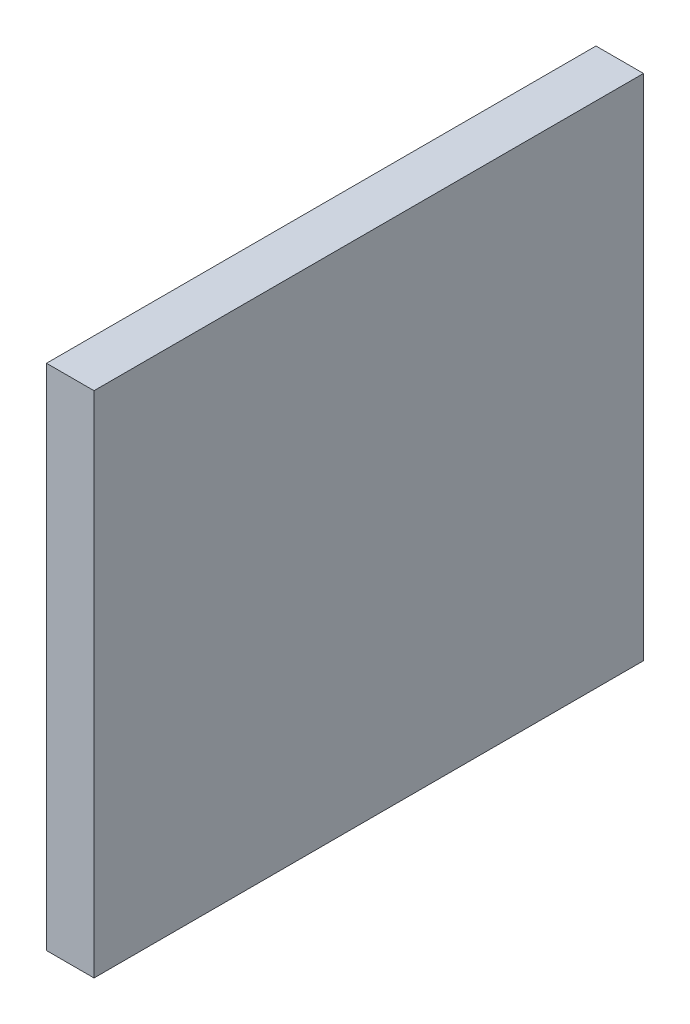
ISO-10303-21;
HEADER;
FILE_DESCRIPTION(('STEP AP214'),'2;1');
FILE_NAME('part.step','',(''),(''),'','','');
FILE_SCHEMA(('AUTOMOTIVE_DESIGN { 1 0 10303 214 1 1 1 1 }'));
ENDSEC;
DATA;
#1=APPLICATION_CONTEXT('core data for automotive mechanical design processes');
#2=APPLICATION_PROTOCOL_DEFINITION('international standard','automotive_design',2000,#1);
#3=PRODUCT_CONTEXT('',#1,'mechanical');
#4=PRODUCT('Part','Part','',(#3));
#5=PRODUCT_RELATED_PRODUCT_CATEGORY('part','',(#4));
#6=PRODUCT_DEFINITION_FORMATION('','',#4);
#7=PRODUCT_DEFINITION_CONTEXT('part definition',#1,'design');
#8=PRODUCT_DEFINITION('design','',#6,#7);
#9=PRODUCT_DEFINITION_SHAPE('','',#8);
#10=(LENGTH_UNIT() NAMED_UNIT(*) SI_UNIT(.MILLI.,.METRE.));
#11=(NAMED_UNIT(*) PLANE_ANGLE_UNIT() SI_UNIT($,.RADIAN.));
#12=(NAMED_UNIT(*) SI_UNIT($,.STERADIAN.) SOLID_ANGLE_UNIT());
#13=UNCERTAINTY_MEASURE_WITH_UNIT(LENGTH_MEASURE(1.E-05),#10,'distance_accuracy_value','');
#14=(GEOMETRIC_REPRESENTATION_CONTEXT(3) GLOBAL_UNCERTAINTY_ASSIGNED_CONTEXT((#13)) GLOBAL_UNIT_ASSIGNED_CONTEXT((#10,
#11,#12)) REPRESENTATION_CONTEXT('',''));
#15=CARTESIAN_POINT('',(0.,0.,0.));
#16=DIRECTION('',(0.,0.,1.));
#17=DIRECTION('',(1.,0.,0.));
#18=AXIS2_PLACEMENT_3D('',#15,#16,#17);
#19=CARTESIAN_POINT('',(-113.6,0.,-220.264426124934));
#20=DIRECTION('',(-1.,0.,0.));
#21=DIRECTION('',(0.,-1.,0.));
#22=AXIS2_PLACEMENT_3D('',#19,#20,#21);
#23=PLANE('',#22);
#24=DIRECTION('',(0.,1.,0.));
#25=VECTOR('',#24,1.);
#26=CARTESIAN_POINT('',(-113.6,0.,-274.));
#27=LINE('',#26,#25);
#28=CARTESIAN_POINT('',(-113.6,-53.5024476045967,-274.));
#29=VERTEX_POINT('',#28);
#30=CARTESIAN_POINT('',(-113.6,0.,-274.));
#31=VERTEX_POINT('',#30);
#32=EDGE_CURVE('E83',#29,#31,#27,.T.);
#33=ORIENTED_EDGE('',*,*,#32,.F.);
#34=DIRECTION('',(0.,0.,-1.));
#35=VECTOR('',#34,1.);
#36=CARTESIAN_POINT('',(-113.6,-53.5024476045967,-220.264426124934));
#37=LINE('',#36,#35);
#38=CARTESIAN_POINT('',(-113.6,-53.5024476045967,-331.8));
#39=VERTEX_POINT('',#38);
#40=EDGE_CURVE('E37',#29,#39,#37,.T.);
#41=ORIENTED_EDGE('',*,*,#40,.T.);
#42=DIRECTION('',(0.,1.,0.));
#43=VECTOR('',#42,1.);
#44=CARTESIAN_POINT('',(-113.6,0.,-331.8));
#45=LINE('',#44,#43);
#46=CARTESIAN_POINT('',(-113.6,0.,-331.8));
#47=VERTEX_POINT('',#46);
#48=EDGE_CURVE('E81',#39,#47,#45,.T.);
#49=ORIENTED_EDGE('',*,*,#48,.T.);
#50=DIRECTION('',(0.,0.,-1.));
#51=VECTOR('',#50,1.);
#52=CARTESIAN_POINT('',(-113.6,0.,-220.264426124934));
#53=LINE('',#52,#51);
#54=EDGE_CURVE('E72',#31,#47,#53,.T.);
#55=ORIENTED_EDGE('',*,*,#54,.F.);
#56=EDGE_LOOP('',(#33,#41,#49,#55));
#57=FACE_BOUND('',#56,.T.);
#58=ADVANCED_FACE('F33',(#57),#23,.F.);
#59=CARTESIAN_POINT('',(-113.6,0.,-220.264426124934));
#60=DIRECTION('',(0.,-1.,0.));
#61=DIRECTION('',(0.,0.,-1.));
#62=AXIS2_PLACEMENT_3D('',#59,#60,#61);
#63=PLANE('',#62);
#64=DIRECTION('',(-1.,0.,0.));
#65=VECTOR('',#64,1.);
#66=CARTESIAN_POINT('',(-240.9,-6.66133814775094E-13,-274.));
#67=LINE('',#66,#65);
#68=CARTESIAN_POINT('',(-118.6,0.,-274.));
#69=VERTEX_POINT('',#68);
#70=EDGE_CURVE('E42',#31,#69,#67,.T.);
#71=ORIENTED_EDGE('',*,*,#70,.F.);
#72=ORIENTED_EDGE('',*,*,#54,.T.);
#73=DIRECTION('',(-1.,0.,0.));
#74=VECTOR('',#73,1.);
#75=CARTESIAN_POINT('',(-113.6,0.,-331.8));
#76=LINE('',#75,#74);
#77=CARTESIAN_POINT('',(-118.6,0.,-331.8));
#78=VERTEX_POINT('',#77);
#79=EDGE_CURVE('E93',#47,#78,#76,.T.);
#80=ORIENTED_EDGE('',*,*,#79,.T.);
#81=DIRECTION('',(0.,0.,-1.));
#82=VECTOR('',#81,1.);
#83=CARTESIAN_POINT('',(-118.6,0.,-220.264426124934));
#84=LINE('',#83,#82);
#85=EDGE_CURVE('E102',#69,#78,#84,.T.);
#86=ORIENTED_EDGE('',*,*,#85,.F.);
#87=EDGE_LOOP('',(#71,#72,#80,#86));
#88=FACE_BOUND('',#87,.T.);
#89=ADVANCED_FACE('F106',(#88),#63,.F.);
#90=CARTESIAN_POINT('',(-118.6,0.,-220.264426124934));
#91=DIRECTION('',(1.,0.,0.));
#92=DIRECTION('',(0.,1.,0.));
#93=AXIS2_PLACEMENT_3D('',#90,#91,#92);
#94=PLANE('',#93);
#95=DIRECTION('',(0.,-1.,0.));
#96=VECTOR('',#95,1.);
#97=CARTESIAN_POINT('',(-118.6,0.,-274.));
#98=LINE('',#97,#96);
#99=CARTESIAN_POINT('',(-118.6,-53.5024476045967,-274.));
#100=VERTEX_POINT('',#99);
#101=EDGE_CURVE('E11',#69,#100,#98,.T.);
#102=ORIENTED_EDGE('',*,*,#101,.F.);
#103=ORIENTED_EDGE('',*,*,#85,.T.);
#104=DIRECTION('',(0.,-1.,0.));
#105=VECTOR('',#104,1.);
#106=CARTESIAN_POINT('',(-118.6,0.,-331.8));
#107=LINE('',#106,#105);
#108=CARTESIAN_POINT('',(-118.6,-53.5024476045967,-331.8));
#109=VERTEX_POINT('',#108);
#110=EDGE_CURVE('E103',#78,#109,#107,.T.);
#111=ORIENTED_EDGE('',*,*,#110,.T.);
#112=DIRECTION('',(0.,0.,-1.));
#113=VECTOR('',#112,1.);
#114=CARTESIAN_POINT('',(-118.6,-53.5024476045967,-220.264426124934));
#115=LINE('',#114,#113);
#116=EDGE_CURVE('E55',#100,#109,#115,.T.);
#117=ORIENTED_EDGE('',*,*,#116,.F.);
#118=EDGE_LOOP('',(#102,#103,#111,#117));
#119=FACE_BOUND('',#118,.T.);
#120=ADVANCED_FACE('F105',(#119),#94,.F.);
#121=CARTESIAN_POINT('',(-113.6,-53.5024476045967,-220.264426124934));
#122=DIRECTION('',(0.,1.,0.));
#123=DIRECTION('',(0.,0.,1.));
#124=AXIS2_PLACEMENT_3D('',#121,#122,#123);
#125=PLANE('',#124);
#126=DIRECTION('',(1.,0.,0.));
#127=VECTOR('',#126,1.);
#128=CARTESIAN_POINT('',(-113.6,-53.5024476045967,-274.));
#129=LINE('',#128,#127);
#130=EDGE_CURVE('E90',#100,#29,#129,.T.);
#131=ORIENTED_EDGE('',*,*,#130,.F.);
#132=ORIENTED_EDGE('',*,*,#116,.T.);
#133=DIRECTION('',(1.,0.,0.));
#134=VECTOR('',#133,1.);
#135=CARTESIAN_POINT('',(-113.6,-53.5024476045967,-331.8));
#136=LINE('',#135,#134);
#137=EDGE_CURVE('E86',#109,#39,#136,.T.);
#138=ORIENTED_EDGE('',*,*,#137,.T.);
#139=ORIENTED_EDGE('',*,*,#40,.F.);
#140=EDGE_LOOP('',(#131,#132,#138,#139));
#141=FACE_BOUND('',#140,.T.);
#142=ADVANCED_FACE('F87',(#141),#125,.F.);
#143=CARTESIAN_POINT('',(0.,0.,-331.8));
#144=DIRECTION('',(0.,0.,-1.));
#145=DIRECTION('',(-1.,0.,0.));
#146=AXIS2_PLACEMENT_3D('',#143,#144,#145);
#147=PLANE('',#146);
#148=ORIENTED_EDGE('',*,*,#48,.F.);
#149=ORIENTED_EDGE('',*,*,#137,.F.);
#150=ORIENTED_EDGE('',*,*,#110,.F.);
#151=ORIENTED_EDGE('',*,*,#79,.F.);
#152=EDGE_LOOP('',(#148,#149,#150,#151));
#153=FACE_BOUND('',#152,.T.);
#154=ADVANCED_FACE('F92',(#153),#147,.T.);
#155=CARTESIAN_POINT('',(971.000000000017,69.0000000000154,-274.));
#156=DIRECTION('',(0.,0.,1.));
#157=DIRECTION('',(1.,0.,0.));
#158=AXIS2_PLACEMENT_3D('',#155,#156,#157);
#159=PLANE('',#158);
#160=ORIENTED_EDGE('',*,*,#130,.T.);
#161=ORIENTED_EDGE('',*,*,#32,.T.);
#162=ORIENTED_EDGE('',*,*,#70,.T.);
#163=ORIENTED_EDGE('',*,*,#101,.T.);
#164=EDGE_LOOP('',(#160,#161,#162,#163));
#165=FACE_BOUND('',#164,.T.);
#166=ADVANCED_FACE('F35',(#165),#159,.T.);
#167=CLOSED_SHELL('',(#58,#89,#120,#142,#154,#166));
#168=MANIFOLD_SOLID_BREP('B2',#167);
#169=ADVANCED_BREP_SHAPE_REPRESENTATION('',(#18,#168),#14);
#170=SHAPE_DEFINITION_REPRESENTATION(#9,#169);
ENDSEC;
END-ISO-10303-21;
